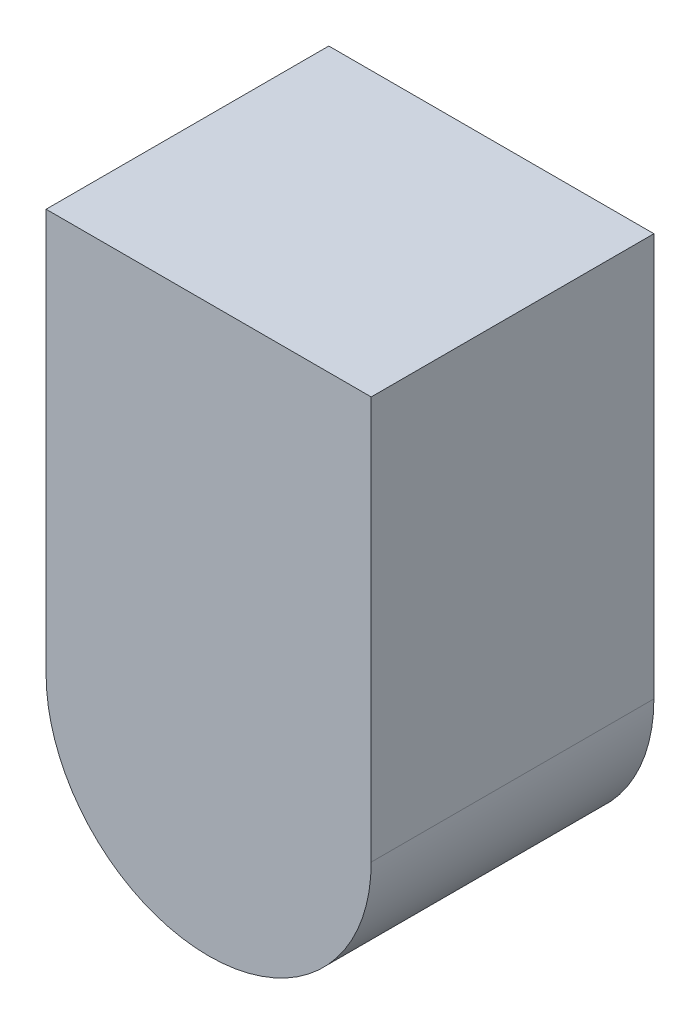
ISO-10303-21;
HEADER;
FILE_DESCRIPTION(('STEP AP214'),'2;1');
FILE_NAME('part.step','',(''),(''),'','','');
FILE_SCHEMA(('AUTOMOTIVE_DESIGN { 1 0 10303 214 1 1 1 1 }'));
ENDSEC;
DATA;
#1=APPLICATION_CONTEXT('core data for automotive mechanical design processes');
#2=APPLICATION_PROTOCOL_DEFINITION('international standard','automotive_design',2000,#1);
#3=PRODUCT_CONTEXT('',#1,'mechanical');
#4=PRODUCT('Part','Part','',(#3));
#5=PRODUCT_RELATED_PRODUCT_CATEGORY('part','',(#4));
#6=PRODUCT_DEFINITION_FORMATION('','',#4);
#7=PRODUCT_DEFINITION_CONTEXT('part definition',#1,'design');
#8=PRODUCT_DEFINITION('design','',#6,#7);
#9=PRODUCT_DEFINITION_SHAPE('','',#8);
#10=(LENGTH_UNIT() NAMED_UNIT(*) SI_UNIT(.MILLI.,.METRE.));
#11=(NAMED_UNIT(*) PLANE_ANGLE_UNIT() SI_UNIT($,.RADIAN.));
#12=(NAMED_UNIT(*) SI_UNIT($,.STERADIAN.) SOLID_ANGLE_UNIT());
#13=UNCERTAINTY_MEASURE_WITH_UNIT(LENGTH_MEASURE(1.E-05),#10,'distance_accuracy_value','');
#14=(GEOMETRIC_REPRESENTATION_CONTEXT(3) GLOBAL_UNCERTAINTY_ASSIGNED_CONTEXT((#13)) GLOBAL_UNIT_ASSIGNED_CONTEXT((#10,
#11,#12)) REPRESENTATION_CONTEXT('',''));
#15=CARTESIAN_POINT('',(0.,0.,0.));
#16=DIRECTION('',(0.,0.,1.));
#17=DIRECTION('',(1.,0.,0.));
#18=AXIS2_PLACEMENT_3D('',#15,#16,#17);
#19=CARTESIAN_POINT('',(-0.75,2.8335240809167,0.2));
#20=DIRECTION('',(0.,0.,1.));
#21=DIRECTION('',(1.,0.,0.));
#22=AXIS2_PLACEMENT_3D('',#19,#20,#21);
#23=PLANE('',#22);
#24=DIRECTION('',(0.,1.,0.));
#25=VECTOR('',#24,1.);
#26=CARTESIAN_POINT('',(-0.635,2.715,0.2));
#27=LINE('',#26,#25);
#28=CARTESIAN_POINT('',(-0.635,2.715,0.2));
#29=VERTEX_POINT('',#28);
#30=CARTESIAN_POINT('',(-0.635,3.,0.2));
#31=VERTEX_POINT('',#30);
#32=EDGE_CURVE('E11',#29,#31,#27,.T.);
#33=ORIENTED_EDGE('',*,*,#32,.T.);
#34=DIRECTION('',(-1.,0.,0.));
#35=VECTOR('',#34,1.);
#36=CARTESIAN_POINT('',(1.125,3.,0.2));
#37=LINE('',#36,#35);
#38=CARTESIAN_POINT('',(-0.865,3.,0.2));
#39=VERTEX_POINT('',#38);
#40=EDGE_CURVE('E24',#31,#39,#37,.T.);
#41=ORIENTED_EDGE('',*,*,#40,.T.);
#42=DIRECTION('',(0.,-1.,0.));
#43=VECTOR('',#42,1.);
#44=CARTESIAN_POINT('',(-0.865,3.,0.2));
#45=LINE('',#44,#43);
#46=CARTESIAN_POINT('',(-0.865,2.715,0.2));
#47=VERTEX_POINT('',#46);
#48=EDGE_CURVE('E88',#39,#47,#45,.T.);
#49=ORIENTED_EDGE('',*,*,#48,.T.);
#50=CARTESIAN_POINT('',(-0.75,2.715,0.2));
#51=DIRECTION('',(0.,0.,1.));
#52=DIRECTION('',(-1.,0.,0.));
#53=AXIS2_PLACEMENT_3D('',#50,#51,#52);
#54=CIRCLE('',#53,0.115);
#55=EDGE_CURVE('E70',#47,#29,#54,.T.);
#56=ORIENTED_EDGE('',*,*,#55,.T.);
#57=EDGE_LOOP('',(#33,#41,#49,#56));
#58=FACE_BOUND('',#57,.T.);
#59=ADVANCED_FACE('F17',(#58),#23,.T.);
#60=CARTESIAN_POINT('',(3.,3.,0.));
#61=DIRECTION('',(0.,1.,0.));
#62=DIRECTION('',(-1.,0.,0.));
#63=AXIS2_PLACEMENT_3D('',#60,#61,#62);
#64=PLANE('',#63);
#65=DIRECTION('',(0.,0.,-1.));
#66=VECTOR('',#65,1.);
#67=CARTESIAN_POINT('',(-0.865,3.,0.));
#68=LINE('',#67,#66);
#69=CARTESIAN_POINT('',(-0.865,3.,0.));
#70=VERTEX_POINT('',#69);
#71=EDGE_CURVE('E76',#39,#70,#68,.T.);
#72=ORIENTED_EDGE('',*,*,#71,.F.);
#73=ORIENTED_EDGE('',*,*,#40,.F.);
#74=DIRECTION('',(0.,0.,1.));
#75=VECTOR('',#74,1.);
#76=CARTESIAN_POINT('',(-0.635,3.,0.));
#77=LINE('',#76,#75);
#78=CARTESIAN_POINT('',(-0.635,3.,0.));
#79=VERTEX_POINT('',#78);
#80=EDGE_CURVE('E84',#79,#31,#77,.T.);
#81=ORIENTED_EDGE('',*,*,#80,.F.);
#82=DIRECTION('',(-1.,0.,0.));
#83=VECTOR('',#82,1.);
#84=CARTESIAN_POINT('',(-0.635,3.,0.));
#85=LINE('',#84,#83);
#86=EDGE_CURVE('E82',#79,#70,#85,.T.);
#87=ORIENTED_EDGE('',*,*,#86,.T.);
#88=EDGE_LOOP('',(#72,#73,#81,#87));
#89=FACE_BOUND('',#88,.T.);
#90=ADVANCED_FACE('F90',(#89),#64,.T.);
#91=CARTESIAN_POINT('',(-0.635,2.715,0.));
#92=DIRECTION('',(1.,0.,0.));
#93=DIRECTION('',(0.,1.,0.));
#94=AXIS2_PLACEMENT_3D('',#91,#92,#93);
#95=PLANE('',#94);
#96=DIRECTION('',(0.,1.,0.));
#97=VECTOR('',#96,1.);
#98=CARTESIAN_POINT('',(-0.635,2.715,0.));
#99=LINE('',#98,#97);
#100=CARTESIAN_POINT('',(-0.635,2.715,0.));
#101=VERTEX_POINT('',#100);
#102=EDGE_CURVE('E61',#101,#79,#99,.T.);
#103=ORIENTED_EDGE('',*,*,#102,.T.);
#104=ORIENTED_EDGE('',*,*,#80,.T.);
#105=ORIENTED_EDGE('',*,*,#32,.F.);
#106=DIRECTION('',(0.,0.,1.));
#107=VECTOR('',#106,1.);
#108=CARTESIAN_POINT('',(-0.635,2.715,0.));
#109=LINE('',#108,#107);
#110=EDGE_CURVE('E64',#101,#29,#109,.T.);
#111=ORIENTED_EDGE('',*,*,#110,.F.);
#112=EDGE_LOOP('',(#103,#104,#105,#111));
#113=FACE_BOUND('',#112,.T.);
#114=ADVANCED_FACE('F91',(#113),#95,.T.);
#115=CARTESIAN_POINT('',(-0.75,2.715,0.));
#116=DIRECTION('',(0.,0.,1.));
#117=DIRECTION('',(-1.,0.,0.));
#118=AXIS2_PLACEMENT_3D('',#115,#116,#117);
#119=CYLINDRICAL_SURFACE('',#118,0.115);
#120=CARTESIAN_POINT('',(-0.75,2.715,0.));
#121=DIRECTION('',(0.,0.,1.));
#122=DIRECTION('',(-1.,0.,0.));
#123=AXIS2_PLACEMENT_3D('',#120,#121,#122);
#124=CIRCLE('',#123,0.115);
#125=CARTESIAN_POINT('',(-0.865,2.715,0.));
#126=VERTEX_POINT('',#125);
#127=EDGE_CURVE('E54',#126,#101,#124,.T.);
#128=ORIENTED_EDGE('',*,*,#127,.T.);
#129=ORIENTED_EDGE('',*,*,#110,.T.);
#130=ORIENTED_EDGE('',*,*,#55,.F.);
#131=DIRECTION('',(0.,0.,1.));
#132=VECTOR('',#131,1.);
#133=CARTESIAN_POINT('',(-0.865,2.715,0.));
#134=LINE('',#133,#132);
#135=EDGE_CURVE('E65',#126,#47,#134,.T.);
#136=ORIENTED_EDGE('',*,*,#135,.F.);
#137=EDGE_LOOP('',(#128,#129,#130,#136));
#138=FACE_BOUND('',#137,.T.);
#139=ADVANCED_FACE('F69',(#138),#119,.T.);
#140=CARTESIAN_POINT('',(-0.865,3.,0.));
#141=DIRECTION('',(-1.,0.,0.));
#142=DIRECTION('',(0.,-1.,0.));
#143=AXIS2_PLACEMENT_3D('',#140,#141,#142);
#144=PLANE('',#143);
#145=DIRECTION('',(0.,-1.,0.));
#146=VECTOR('',#145,1.);
#147=CARTESIAN_POINT('',(-0.865,3.,0.));
#148=LINE('',#147,#146);
#149=EDGE_CURVE('E59',#70,#126,#148,.T.);
#150=ORIENTED_EDGE('',*,*,#149,.T.);
#151=ORIENTED_EDGE('',*,*,#135,.T.);
#152=ORIENTED_EDGE('',*,*,#48,.F.);
#153=ORIENTED_EDGE('',*,*,#71,.T.);
#154=EDGE_LOOP('',(#150,#151,#152,#153));
#155=FACE_BOUND('',#154,.T.);
#156=ADVANCED_FACE('F74',(#155),#144,.T.);
#157=CARTESIAN_POINT('',(-0.75,2.8335265642716,0.));
#158=DIRECTION('',(0.,0.,1.));
#159=DIRECTION('',(0.,-1.,0.));
#160=AXIS2_PLACEMENT_3D('',#157,#158,#159);
#161=PLANE('',#160);
#162=ORIENTED_EDGE('',*,*,#86,.F.);
#163=ORIENTED_EDGE('',*,*,#102,.F.);
#164=ORIENTED_EDGE('',*,*,#127,.F.);
#165=ORIENTED_EDGE('',*,*,#149,.F.);
#166=EDGE_LOOP('',(#162,#163,#164,#165));
#167=FACE_BOUND('',#166,.T.);
#168=ADVANCED_FACE('F57',(#167),#161,.F.);
#169=CLOSED_SHELL('',(#59,#90,#114,#139,#156,#168));
#170=MANIFOLD_SOLID_BREP('B1',#169);
#171=ADVANCED_BREP_SHAPE_REPRESENTATION('',(#18,#170),#14);
#172=SHAPE_DEFINITION_REPRESENTATION(#9,#171);
ENDSEC;
END-ISO-10303-21;
